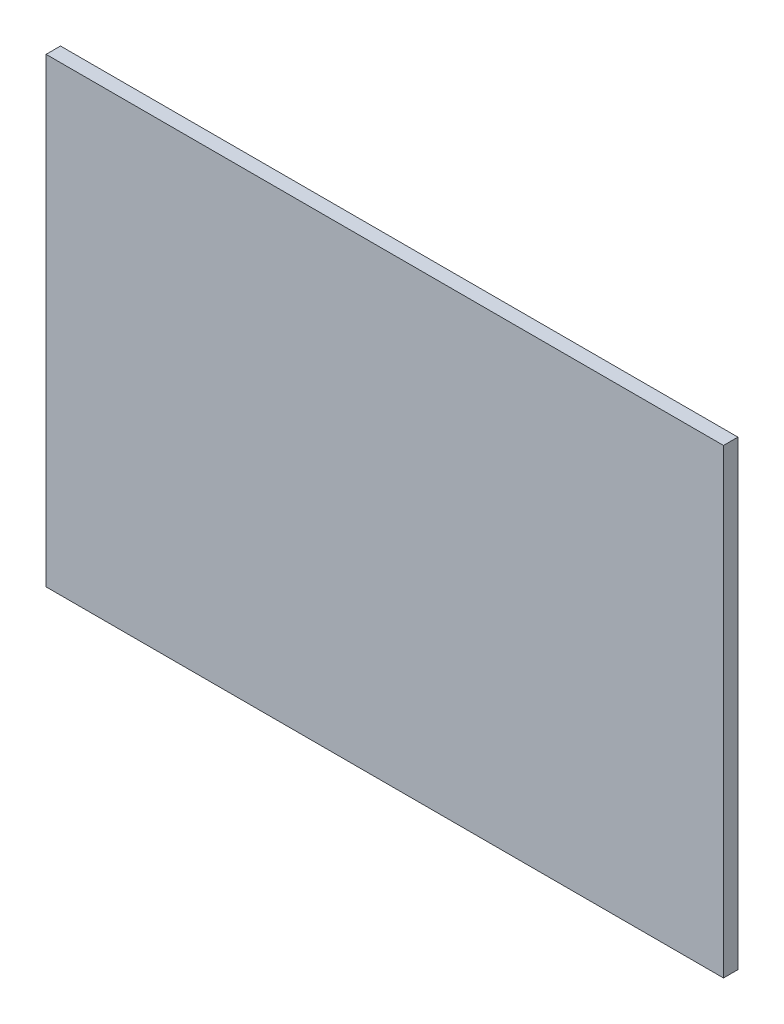
ISO-10303-21;
HEADER;
FILE_DESCRIPTION(('STEP AP214'),'2;1');
FILE_NAME('part.step','',(''),(''),'','','');
FILE_SCHEMA(('AUTOMOTIVE_DESIGN { 1 0 10303 214 1 1 1 1 }'));
ENDSEC;
DATA;
#1=APPLICATION_CONTEXT('core data for automotive mechanical design processes');
#2=APPLICATION_PROTOCOL_DEFINITION('international standard','automotive_design',2000,#1);
#3=PRODUCT_CONTEXT('',#1,'mechanical');
#4=PRODUCT('Part','Part','',(#3));
#5=PRODUCT_RELATED_PRODUCT_CATEGORY('part','',(#4));
#6=PRODUCT_DEFINITION_FORMATION('','',#4);
#7=PRODUCT_DEFINITION_CONTEXT('part definition',#1,'design');
#8=PRODUCT_DEFINITION('design','',#6,#7);
#9=PRODUCT_DEFINITION_SHAPE('','',#8);
#10=(LENGTH_UNIT() NAMED_UNIT(*) SI_UNIT(.MILLI.,.METRE.));
#11=(NAMED_UNIT(*) PLANE_ANGLE_UNIT() SI_UNIT($,.RADIAN.));
#12=(NAMED_UNIT(*) SI_UNIT($,.STERADIAN.) SOLID_ANGLE_UNIT());
#13=UNCERTAINTY_MEASURE_WITH_UNIT(LENGTH_MEASURE(1.E-05),#10,'distance_accuracy_value','');
#14=(GEOMETRIC_REPRESENTATION_CONTEXT(3) GLOBAL_UNCERTAINTY_ASSIGNED_CONTEXT((#13)) GLOBAL_UNIT_ASSIGNED_CONTEXT((#10,
#11,#12)) REPRESENTATION_CONTEXT('',''));
#15=CARTESIAN_POINT('',(0.,0.,0.));
#16=DIRECTION('',(0.,0.,1.));
#17=DIRECTION('',(1.,0.,0.));
#18=AXIS2_PLACEMENT_3D('',#15,#16,#17);
#19=CARTESIAN_POINT('',(74.6125,50.8,3.175));
#20=DIRECTION('',(-1.,0.,0.));
#21=DIRECTION('',(0.,-1.,0.));
#22=AXIS2_PLACEMENT_3D('',#19,#20,#21);
#23=PLANE('',#22);
#24=DIRECTION('',(0.,1.,0.));
#25=VECTOR('',#24,1.);
#26=CARTESIAN_POINT('',(74.6125,50.8,0.));
#27=LINE('',#26,#25);
#28=CARTESIAN_POINT('',(74.6125,-50.8,0.));
#29=VERTEX_POINT('',#28);
#30=CARTESIAN_POINT('',(74.6125,50.8,0.));
#31=VERTEX_POINT('',#30);
#32=EDGE_CURVE('E95',#29,#31,#27,.T.);
#33=ORIENTED_EDGE('',*,*,#32,.T.);
#34=DIRECTION('',(0.,0.,-1.));
#35=VECTOR('',#34,1.);
#36=CARTESIAN_POINT('',(74.6125,50.8,3.175));
#37=LINE('',#36,#35);
#38=CARTESIAN_POINT('',(74.6125,50.8,3.175));
#39=VERTEX_POINT('',#38);
#40=EDGE_CURVE('E11',#39,#31,#37,.T.);
#41=ORIENTED_EDGE('',*,*,#40,.F.);
#42=DIRECTION('',(0.,1.,0.));
#43=VECTOR('',#42,1.);
#44=CARTESIAN_POINT('',(74.6125,50.8,3.175));
#45=LINE('',#44,#43);
#46=CARTESIAN_POINT('',(74.6125,-50.8,3.175));
#47=VERTEX_POINT('',#46);
#48=EDGE_CURVE('E83',#47,#39,#45,.T.);
#49=ORIENTED_EDGE('',*,*,#48,.F.);
#50=DIRECTION('',(0.,0.,-1.));
#51=VECTOR('',#50,1.);
#52=CARTESIAN_POINT('',(74.6125,-50.8,3.175));
#53=LINE('',#52,#51);
#54=EDGE_CURVE('E91',#47,#29,#53,.T.);
#55=ORIENTED_EDGE('',*,*,#54,.T.);
#56=EDGE_LOOP('',(#33,#41,#49,#55));
#57=FACE_BOUND('',#56,.T.);
#58=ADVANCED_FACE('F32',(#57),#23,.F.);
#59=CARTESIAN_POINT('',(-74.6125,50.8,3.175));
#60=DIRECTION('',(0.,-1.,0.));
#61=DIRECTION('',(0.,0.,-1.));
#62=AXIS2_PLACEMENT_3D('',#59,#60,#61);
#63=PLANE('',#62);
#64=DIRECTION('',(-1.,0.,0.));
#65=VECTOR('',#64,1.);
#66=CARTESIAN_POINT('',(-74.6125,50.8,0.));
#67=LINE('',#66,#65);
#68=CARTESIAN_POINT('',(-74.6125,50.8,0.));
#69=VERTEX_POINT('',#68);
#70=EDGE_CURVE('E87',#31,#69,#67,.T.);
#71=ORIENTED_EDGE('',*,*,#70,.T.);
#72=DIRECTION('',(0.,0.,-1.));
#73=VECTOR('',#72,1.);
#74=CARTESIAN_POINT('',(-74.6125,50.8,3.175));
#75=LINE('',#74,#73);
#76=CARTESIAN_POINT('',(-74.6125,50.8,3.175));
#77=VERTEX_POINT('',#76);
#78=EDGE_CURVE('E40',#77,#69,#75,.T.);
#79=ORIENTED_EDGE('',*,*,#78,.F.);
#80=DIRECTION('',(-1.,0.,0.));
#81=VECTOR('',#80,1.);
#82=CARTESIAN_POINT('',(-74.6125,50.8,3.175));
#83=LINE('',#82,#81);
#84=EDGE_CURVE('E78',#39,#77,#83,.T.);
#85=ORIENTED_EDGE('',*,*,#84,.F.);
#86=ORIENTED_EDGE('',*,*,#40,.T.);
#87=EDGE_LOOP('',(#71,#79,#85,#86));
#88=FACE_BOUND('',#87,.T.);
#89=ADVANCED_FACE('F86',(#88),#63,.F.);
#90=CARTESIAN_POINT('',(-74.6125,50.8,3.175));
#91=DIRECTION('',(1.,0.,0.));
#92=DIRECTION('',(0.,1.,0.));
#93=AXIS2_PLACEMENT_3D('',#90,#91,#92);
#94=PLANE('',#93);
#95=DIRECTION('',(0.,-1.,0.));
#96=VECTOR('',#95,1.);
#97=CARTESIAN_POINT('',(-74.6125,50.8,0.));
#98=LINE('',#97,#96);
#99=CARTESIAN_POINT('',(-74.6125,-50.8,0.));
#100=VERTEX_POINT('',#99);
#101=EDGE_CURVE('E65',#69,#100,#98,.T.);
#102=ORIENTED_EDGE('',*,*,#101,.T.);
#103=DIRECTION('',(0.,0.,-1.));
#104=VECTOR('',#103,1.);
#105=CARTESIAN_POINT('',(-74.6125,-50.8,3.175));
#106=LINE('',#105,#104);
#107=CARTESIAN_POINT('',(-74.6125,-50.8,3.175));
#108=VERTEX_POINT('',#107);
#109=EDGE_CURVE('E88',#108,#100,#106,.T.);
#110=ORIENTED_EDGE('',*,*,#109,.F.);
#111=DIRECTION('',(0.,-1.,0.));
#112=VECTOR('',#111,1.);
#113=CARTESIAN_POINT('',(-74.6125,50.8,3.175));
#114=LINE('',#113,#112);
#115=EDGE_CURVE('E81',#77,#108,#114,.T.);
#116=ORIENTED_EDGE('',*,*,#115,.F.);
#117=ORIENTED_EDGE('',*,*,#78,.T.);
#118=EDGE_LOOP('',(#102,#110,#116,#117));
#119=FACE_BOUND('',#118,.T.);
#120=ADVANCED_FACE('F89',(#119),#94,.F.);
#121=CARTESIAN_POINT('',(-74.6125,-50.8,3.175));
#122=DIRECTION('',(0.,1.,0.));
#123=DIRECTION('',(0.,0.,1.));
#124=AXIS2_PLACEMENT_3D('',#121,#122,#123);
#125=PLANE('',#124);
#126=DIRECTION('',(1.,0.,0.));
#127=VECTOR('',#126,1.);
#128=CARTESIAN_POINT('',(-74.6125,-50.8,0.));
#129=LINE('',#128,#127);
#130=EDGE_CURVE('E71',#100,#29,#129,.T.);
#131=ORIENTED_EDGE('',*,*,#130,.T.);
#132=ORIENTED_EDGE('',*,*,#54,.F.);
#133=DIRECTION('',(1.,0.,0.));
#134=VECTOR('',#133,1.);
#135=CARTESIAN_POINT('',(-74.6125,-50.8,3.175));
#136=LINE('',#135,#134);
#137=EDGE_CURVE('E48',#108,#47,#136,.T.);
#138=ORIENTED_EDGE('',*,*,#137,.F.);
#139=ORIENTED_EDGE('',*,*,#109,.T.);
#140=EDGE_LOOP('',(#131,#132,#138,#139));
#141=FACE_BOUND('',#140,.T.);
#142=ADVANCED_FACE('F102',(#141),#125,.F.);
#143=CARTESIAN_POINT('',(0.,0.,3.175));
#144=DIRECTION('',(0.,0.,1.));
#145=DIRECTION('',(1.,0.,0.));
#146=AXIS2_PLACEMENT_3D('',#143,#144,#145);
#147=PLANE('',#146);
#148=ORIENTED_EDGE('',*,*,#48,.T.);
#149=ORIENTED_EDGE('',*,*,#84,.T.);
#150=ORIENTED_EDGE('',*,*,#115,.T.);
#151=ORIENTED_EDGE('',*,*,#137,.T.);
#152=EDGE_LOOP('',(#148,#149,#150,#151));
#153=FACE_BOUND('',#152,.T.);
#154=ADVANCED_FACE('F79',(#153),#147,.T.);
#155=CARTESIAN_POINT('',(0.,0.,0.));
#156=DIRECTION('',(0.,0.,1.));
#157=DIRECTION('',(1.,0.,0.));
#158=AXIS2_PLACEMENT_3D('',#155,#156,#157);
#159=PLANE('',#158);
#160=ORIENTED_EDGE('',*,*,#32,.F.);
#161=ORIENTED_EDGE('',*,*,#130,.F.);
#162=ORIENTED_EDGE('',*,*,#101,.F.);
#163=ORIENTED_EDGE('',*,*,#70,.F.);
#164=EDGE_LOOP('',(#160,#161,#162,#163));
#165=FACE_BOUND('',#164,.T.);
#166=ADVANCED_FACE('F105',(#165),#159,.F.);
#167=CLOSED_SHELL('',(#58,#89,#120,#142,#154,#166));
#168=MANIFOLD_SOLID_BREP('B2',#167);
#169=ADVANCED_BREP_SHAPE_REPRESENTATION('',(#18,#168),#14);
#170=SHAPE_DEFINITION_REPRESENTATION(#9,#169);
ENDSEC;
END-ISO-10303-21;
